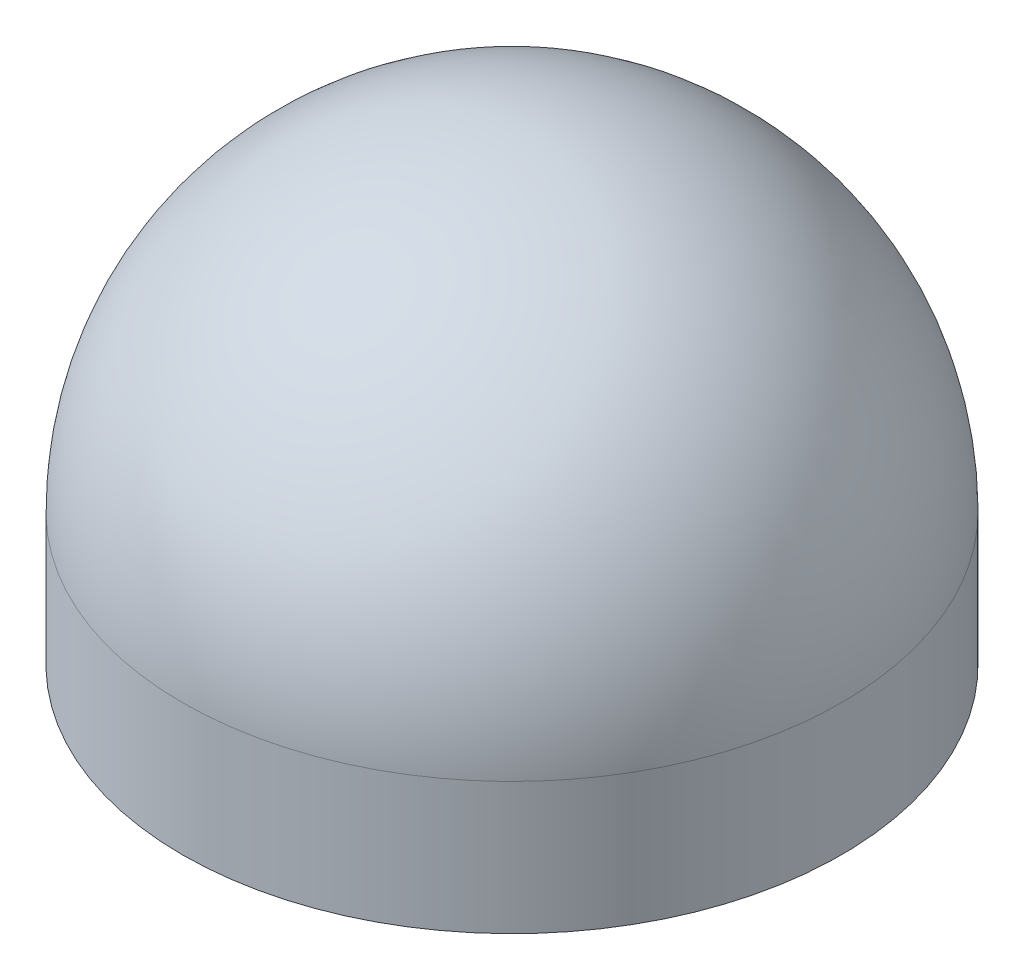
ISO-10303-21;
HEADER;
FILE_DESCRIPTION(('STEP AP214'),'2;1');
FILE_NAME('part.step','',(''),(''),'','','');
FILE_SCHEMA(('AUTOMOTIVE_DESIGN { 1 0 10303 214 1 1 1 1 }'));
ENDSEC;
DATA;
#1=APPLICATION_CONTEXT('core data for automotive mechanical design processes');
#2=APPLICATION_PROTOCOL_DEFINITION('international standard','automotive_design',2000,#1);
#3=PRODUCT_CONTEXT('',#1,'mechanical');
#4=PRODUCT('Part','Part','',(#3));
#5=PRODUCT_RELATED_PRODUCT_CATEGORY('part','',(#4));
#6=PRODUCT_DEFINITION_FORMATION('','',#4);
#7=PRODUCT_DEFINITION_CONTEXT('part definition',#1,'design');
#8=PRODUCT_DEFINITION('design','',#6,#7);
#9=PRODUCT_DEFINITION_SHAPE('','',#8);
#10=(LENGTH_UNIT() NAMED_UNIT(*) SI_UNIT(.MILLI.,.METRE.));
#11=(NAMED_UNIT(*) PLANE_ANGLE_UNIT() SI_UNIT($,.RADIAN.));
#12=(NAMED_UNIT(*) SI_UNIT($,.STERADIAN.) SOLID_ANGLE_UNIT());
#13=UNCERTAINTY_MEASURE_WITH_UNIT(LENGTH_MEASURE(1.E-05),#10,'distance_accuracy_value','');
#14=(GEOMETRIC_REPRESENTATION_CONTEXT(3) GLOBAL_UNCERTAINTY_ASSIGNED_CONTEXT((#13)) GLOBAL_UNIT_ASSIGNED_CONTEXT((#10,
#11,#12)) REPRESENTATION_CONTEXT('',''));
#15=CARTESIAN_POINT('',(0.,0.,0.));
#16=DIRECTION('',(0.,0.,1.));
#17=DIRECTION('',(1.,0.,0.));
#18=AXIS2_PLACEMENT_3D('',#15,#16,#17);
#19=CARTESIAN_POINT('',(0.,7.,0.));
#20=DIRECTION('',(0.,-1.,0.));
#21=DIRECTION('',(0.,0.,-1.));
#22=AXIS2_PLACEMENT_3D('',#19,#20,#21);
#23=CYLINDRICAL_SURFACE('',#22,5.);
#24=CARTESIAN_POINT('',(0.,2.,0.));
#25=DIRECTION('',(0.,-1.,0.));
#26=DIRECTION('',(0.,0.,-1.));
#27=AXIS2_PLACEMENT_3D('',#24,#25,#26);
#28=CIRCLE('',#27,5.);
#29=CARTESIAN_POINT('',(0.,2.,-5.));
#30=VERTEX_POINT('',#29);
#31=EDGE_CURVE('E10',#30,#30,#28,.T.);
#32=ORIENTED_EDGE('',*,*,#31,.T.);
#33=EDGE_LOOP('',(#32));
#34=FACE_BOUND('',#33,.T.);
#35=CARTESIAN_POINT('',(0.,0.,0.));
#36=DIRECTION('',(0.,1.,0.));
#37=DIRECTION('',(0.,0.,1.));
#38=AXIS2_PLACEMENT_3D('',#35,#36,#37);
#39=CIRCLE('',#38,5.);
#40=CARTESIAN_POINT('',(0.,0.,5.));
#41=VERTEX_POINT('',#40);
#42=EDGE_CURVE('E38',#41,#41,#39,.T.);
#43=ORIENTED_EDGE('',*,*,#42,.T.);
#44=EDGE_LOOP('',(#43));
#45=FACE_BOUND('',#44,.T.);
#46=ADVANCED_FACE('F31',(#34,#45),#23,.T.);
#47=CARTESIAN_POINT('',(0.,0.,0.));
#48=DIRECTION('',(0.,1.,0.));
#49=DIRECTION('',(0.,0.,1.));
#50=AXIS2_PLACEMENT_3D('',#47,#48,#49);
#51=PLANE('',#50);
#52=CARTESIAN_POINT('',(0.,0.,0.));
#53=DIRECTION('',(0.,-1.,0.));
#54=DIRECTION('',(0.,0.,-1.));
#55=AXIS2_PLACEMENT_3D('',#52,#53,#54);
#56=CIRCLE('',#55,1.75);
#57=CARTESIAN_POINT('',(0.,0.,-1.75));
#58=VERTEX_POINT('',#57);
#59=EDGE_CURVE('E46',#58,#58,#56,.T.);
#60=ORIENTED_EDGE('',*,*,#59,.F.);
#61=EDGE_LOOP('',(#60));
#62=FACE_BOUND('',#61,.T.);
#63=ORIENTED_EDGE('',*,*,#42,.F.);
#64=EDGE_LOOP('',(#63));
#65=FACE_BOUND('',#64,.T.);
#66=ADVANCED_FACE('F54',(#62,#65),#51,.F.);
#67=CARTESIAN_POINT('',(0.,2.,0.));
#68=DIRECTION('',(0.,1.,0.));
#69=DIRECTION('',(0.,0.,1.));
#70=AXIS2_PLACEMENT_3D('',#67,#68,#69);
#71=SPHERICAL_SURFACE('',#70,5.);
#72=ORIENTED_EDGE('',*,*,#31,.F.);
#73=EDGE_LOOP('',(#72));
#74=FACE_BOUND('',#73,.T.);
#75=ADVANCED_FACE('F33',(#74),#71,.T.);
#76=CARTESIAN_POINT('',(0.,4.,0.));
#77=DIRECTION('',(0.,-1.,0.));
#78=DIRECTION('',(0.,0.,-1.));
#79=AXIS2_PLACEMENT_3D('',#76,#77,#78);
#80=CYLINDRICAL_SURFACE('',#79,1.75);
#81=CARTESIAN_POINT('',(0.,4.,0.));
#82=DIRECTION('',(0.,-1.,0.));
#83=DIRECTION('',(0.,0.,-1.));
#84=AXIS2_PLACEMENT_3D('',#81,#82,#83);
#85=CIRCLE('',#84,1.75);
#86=CARTESIAN_POINT('',(0.,4.,-1.75));
#87=VERTEX_POINT('',#86);
#88=EDGE_CURVE('E42',#87,#87,#85,.T.);
#89=ORIENTED_EDGE('',*,*,#88,.F.);
#90=EDGE_LOOP('',(#89));
#91=FACE_BOUND('',#90,.T.);
#92=ORIENTED_EDGE('',*,*,#59,.T.);
#93=EDGE_LOOP('',(#92));
#94=FACE_BOUND('',#93,.T.);
#95=ADVANCED_FACE('F52',(#91,#94),#80,.F.);
#96=CARTESIAN_POINT('',(0.,4.,0.));
#97=DIRECTION('',(0.,-1.,0.));
#98=DIRECTION('',(0.,0.,-1.));
#99=AXIS2_PLACEMENT_3D('',#96,#97,#98);
#100=PLANE('',#99);
#101=ORIENTED_EDGE('',*,*,#88,.T.);
#102=EDGE_LOOP('',(#101));
#103=FACE_BOUND('',#102,.T.);
#104=ADVANCED_FACE('F66',(#103),#100,.T.);
#105=CLOSED_SHELL('',(#46,#66,#75,#95,#104));
#106=MANIFOLD_SOLID_BREP('B2',#105);
#107=ADVANCED_BREP_SHAPE_REPRESENTATION('',(#18,#106),#14);
#108=SHAPE_DEFINITION_REPRESENTATION(#9,#107);
ENDSEC;
END-ISO-10303-21;
